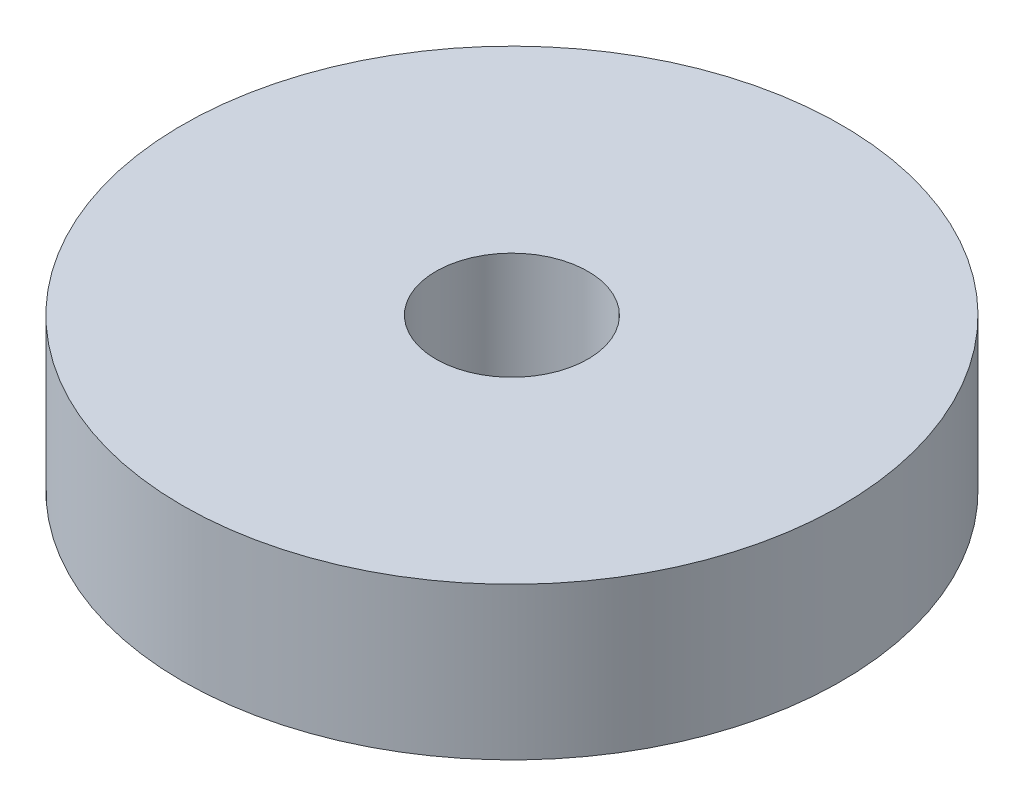
ISO-10303-21;
HEADER;
FILE_DESCRIPTION(('STEP AP214'),'2;1');
FILE_NAME('part.step','',(''),(''),'','','');
FILE_SCHEMA(('AUTOMOTIVE_DESIGN { 1 0 10303 214 1 1 1 1 }'));
ENDSEC;
DATA;
#1=APPLICATION_CONTEXT('core data for automotive mechanical design processes');
#2=APPLICATION_PROTOCOL_DEFINITION('international standard','automotive_design',2000,#1);
#3=PRODUCT_CONTEXT('',#1,'mechanical');
#4=PRODUCT('Part','Part','',(#3));
#5=PRODUCT_RELATED_PRODUCT_CATEGORY('part','',(#4));
#6=PRODUCT_DEFINITION_FORMATION('','',#4);
#7=PRODUCT_DEFINITION_CONTEXT('part definition',#1,'design');
#8=PRODUCT_DEFINITION('design','',#6,#7);
#9=PRODUCT_DEFINITION_SHAPE('','',#8);
#10=(LENGTH_UNIT() NAMED_UNIT(*) SI_UNIT(.MILLI.,.METRE.));
#11=(NAMED_UNIT(*) PLANE_ANGLE_UNIT() SI_UNIT($,.RADIAN.));
#12=(NAMED_UNIT(*) SI_UNIT($,.STERADIAN.) SOLID_ANGLE_UNIT());
#13=UNCERTAINTY_MEASURE_WITH_UNIT(LENGTH_MEASURE(1.E-05),#10,'distance_accuracy_value','');
#14=(GEOMETRIC_REPRESENTATION_CONTEXT(3) GLOBAL_UNCERTAINTY_ASSIGNED_CONTEXT((#13)) GLOBAL_UNIT_ASSIGNED_CONTEXT((#10,
#11,#12)) REPRESENTATION_CONTEXT('',''));
#15=CARTESIAN_POINT('',(0.,0.,0.));
#16=DIRECTION('',(0.,0.,1.));
#17=DIRECTION('',(1.,0.,0.));
#18=AXIS2_PLACEMENT_3D('',#15,#16,#17);
#19=CARTESIAN_POINT('',(0.,3.,0.));
#20=DIRECTION('',(0.,1.,0.));
#21=DIRECTION('',(0.,0.,1.));
#22=AXIS2_PLACEMENT_3D('',#19,#20,#21);
#23=PLANE('',#22);
#24=CARTESIAN_POINT('',(0.,3.,0.));
#25=DIRECTION('',(0.,1.,0.));
#26=DIRECTION('',(0.,0.,1.));
#27=AXIS2_PLACEMENT_3D('',#24,#25,#26);
#28=CIRCLE('',#27,6.5);
#29=CARTESIAN_POINT('',(0.,3.,6.5));
#30=VERTEX_POINT('',#29);
#31=EDGE_CURVE('E10',#30,#30,#28,.T.);
#32=ORIENTED_EDGE('',*,*,#31,.T.);
#33=EDGE_LOOP('',(#32));
#34=FACE_BOUND('',#33,.T.);
#35=CARTESIAN_POINT('',(0.,3.,0.));
#36=DIRECTION('',(0.,1.,0.));
#37=DIRECTION('',(0.,0.,1.));
#38=AXIS2_PLACEMENT_3D('',#35,#36,#37);
#39=CIRCLE('',#38,1.5);
#40=CARTESIAN_POINT('',(0.,3.,1.5));
#41=VERTEX_POINT('',#40);
#42=EDGE_CURVE('E46',#41,#41,#39,.T.);
#43=ORIENTED_EDGE('',*,*,#42,.F.);
#44=EDGE_LOOP('',(#43));
#45=FACE_BOUND('',#44,.T.);
#46=ADVANCED_FACE('F35',(#34,#45),#23,.T.);
#47=CARTESIAN_POINT('',(0.,0.,0.));
#48=DIRECTION('',(0.,1.,0.));
#49=DIRECTION('',(0.,0.,1.));
#50=AXIS2_PLACEMENT_3D('',#47,#48,#49);
#51=PLANE('',#50);
#52=CARTESIAN_POINT('',(0.,0.,0.));
#53=DIRECTION('',(0.,1.,0.));
#54=DIRECTION('',(0.,0.,1.));
#55=AXIS2_PLACEMENT_3D('',#52,#53,#54);
#56=CIRCLE('',#55,6.5);
#57=CARTESIAN_POINT('',(0.,0.,6.5));
#58=VERTEX_POINT('',#57);
#59=EDGE_CURVE('E39',#58,#58,#56,.T.);
#60=ORIENTED_EDGE('',*,*,#59,.F.);
#61=EDGE_LOOP('',(#60));
#62=FACE_BOUND('',#61,.T.);
#63=CARTESIAN_POINT('',(0.,0.,0.));
#64=DIRECTION('',(0.,1.,0.));
#65=DIRECTION('',(0.,0.,1.));
#66=AXIS2_PLACEMENT_3D('',#63,#64,#65);
#67=CIRCLE('',#66,1.5);
#68=CARTESIAN_POINT('',(0.,0.,1.5));
#69=VERTEX_POINT('',#68);
#70=EDGE_CURVE('E48',#69,#69,#67,.T.);
#71=ORIENTED_EDGE('',*,*,#70,.T.);
#72=EDGE_LOOP('',(#71));
#73=FACE_BOUND('',#72,.T.);
#74=ADVANCED_FACE('F58',(#62,#73),#51,.F.);
#75=CARTESIAN_POINT('',(0.,3.,0.));
#76=DIRECTION('',(0.,-1.,0.));
#77=DIRECTION('',(0.,0.,-1.));
#78=AXIS2_PLACEMENT_3D('',#75,#76,#77);
#79=CYLINDRICAL_SURFACE('',#78,6.5);
#80=ORIENTED_EDGE('',*,*,#31,.F.);
#81=EDGE_LOOP('',(#80));
#82=FACE_BOUND('',#81,.T.);
#83=ORIENTED_EDGE('',*,*,#59,.T.);
#84=EDGE_LOOP('',(#83));
#85=FACE_BOUND('',#84,.T.);
#86=ADVANCED_FACE('F37',(#82,#85),#79,.T.);
#87=CARTESIAN_POINT('',(0.,3.,0.));
#88=DIRECTION('',(0.,-1.,0.));
#89=DIRECTION('',(0.,0.,-1.));
#90=AXIS2_PLACEMENT_3D('',#87,#88,#89);
#91=CYLINDRICAL_SURFACE('',#90,1.5);
#92=ORIENTED_EDGE('',*,*,#42,.T.);
#93=EDGE_LOOP('',(#92));
#94=FACE_BOUND('',#93,.T.);
#95=ORIENTED_EDGE('',*,*,#70,.F.);
#96=EDGE_LOOP('',(#95));
#97=FACE_BOUND('',#96,.T.);
#98=ADVANCED_FACE('F54',(#94,#97),#91,.F.);
#99=CLOSED_SHELL('',(#46,#74,#86,#98));
#100=MANIFOLD_SOLID_BREP('B2',#99);
#101=ADVANCED_BREP_SHAPE_REPRESENTATION('',(#18,#100),#14);
#102=SHAPE_DEFINITION_REPRESENTATION(#9,#101);
ENDSEC;
END-ISO-10303-21;
